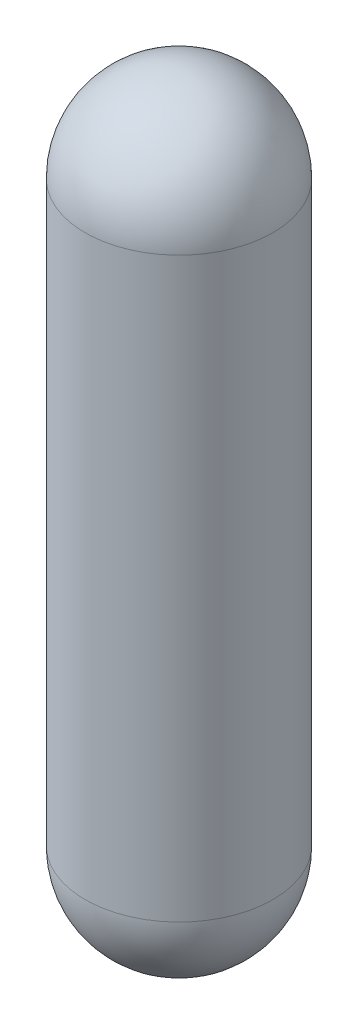
ISO-10303-21;
HEADER;
FILE_DESCRIPTION(('STEP AP214'),'2;1');
FILE_NAME('part.step','',(''),(''),'','','');
FILE_SCHEMA(('AUTOMOTIVE_DESIGN { 1 0 10303 214 1 1 1 1 }'));
ENDSEC;
DATA;
#1=APPLICATION_CONTEXT('core data for automotive mechanical design processes');
#2=APPLICATION_PROTOCOL_DEFINITION('international standard','automotive_design',2000,#1);
#3=PRODUCT_CONTEXT('',#1,'mechanical');
#4=PRODUCT('Part','Part','',(#3));
#5=PRODUCT_RELATED_PRODUCT_CATEGORY('part','',(#4));
#6=PRODUCT_DEFINITION_FORMATION('','',#4);
#7=PRODUCT_DEFINITION_CONTEXT('part definition',#1,'design');
#8=PRODUCT_DEFINITION('design','',#6,#7);
#9=PRODUCT_DEFINITION_SHAPE('','',#8);
#10=(LENGTH_UNIT() NAMED_UNIT(*) SI_UNIT(.MILLI.,.METRE.));
#11=(NAMED_UNIT(*) PLANE_ANGLE_UNIT() SI_UNIT($,.RADIAN.));
#12=(NAMED_UNIT(*) SI_UNIT($,.STERADIAN.) SOLID_ANGLE_UNIT());
#13=UNCERTAINTY_MEASURE_WITH_UNIT(LENGTH_MEASURE(1.E-05),#10,'distance_accuracy_value','');
#14=(GEOMETRIC_REPRESENTATION_CONTEXT(3) GLOBAL_UNCERTAINTY_ASSIGNED_CONTEXT((#13)) GLOBAL_UNIT_ASSIGNED_CONTEXT((#10,
#11,#12)) REPRESENTATION_CONTEXT('',''));
#15=CARTESIAN_POINT('',(0.,0.,0.));
#16=DIRECTION('',(0.,0.,1.));
#17=DIRECTION('',(1.,0.,0.));
#18=AXIS2_PLACEMENT_3D('',#15,#16,#17);
#19=CARTESIAN_POINT('',(0.,-1553.82946096654,0.));
#20=DIRECTION('',(0.,-1.,0.));
#21=DIRECTION('',(1.,0.,0.));
#22=AXIS2_PLACEMENT_3D('',#19,#20,#21);
#23=SPHERICAL_SURFACE('',#22,539.75);
#24=CARTESIAN_POINT('',(0.,-1553.82946096654,0.));
#25=DIRECTION('',(0.,-1.,0.));
#26=DIRECTION('',(1.,0.,0.));
#27=AXIS2_PLACEMENT_3D('',#24,#25,#26);
#28=CIRCLE('',#27,539.75);
#29=CARTESIAN_POINT('',(539.75,-1553.82946096654,0.));
#30=VERTEX_POINT('',#29);
#31=EDGE_CURVE('E44',#30,#30,#28,.T.);
#32=ORIENTED_EDGE('',*,*,#31,.T.);
#33=EDGE_LOOP('',(#32));
#34=FACE_BOUND('',#33,.T.);
#35=ADVANCED_FACE('F38',(#34),#23,.T.);
#36=CARTESIAN_POINT('',(0.,1766.67053903346,0.));
#37=DIRECTION('',(0.,-1.,0.));
#38=DIRECTION('',(1.,0.,0.));
#39=AXIS2_PLACEMENT_3D('',#36,#37,#38);
#40=SPHERICAL_SURFACE('',#39,539.75);
#41=CARTESIAN_POINT('',(0.,1766.67053903346,0.));
#42=DIRECTION('',(0.,-1.,0.));
#43=DIRECTION('',(1.,0.,0.));
#44=AXIS2_PLACEMENT_3D('',#41,#42,#43);
#45=CIRCLE('',#44,539.75);
#46=CARTESIAN_POINT('',(539.75,1766.67053903346,0.));
#47=VERTEX_POINT('',#46);
#48=EDGE_CURVE('E10',#47,#47,#45,.T.);
#49=ORIENTED_EDGE('',*,*,#48,.F.);
#50=EDGE_LOOP('',(#49));
#51=FACE_BOUND('',#50,.T.);
#52=ADVANCED_FACE('F53',(#51),#40,.T.);
#53=CARTESIAN_POINT('',(0.,-1553.82946096654,0.));
#54=DIRECTION('',(0.,-1.,0.));
#55=DIRECTION('',(1.,0.,0.));
#56=AXIS2_PLACEMENT_3D('',#53,#54,#55);
#57=CYLINDRICAL_SURFACE('',#56,539.75);
#58=ORIENTED_EDGE('',*,*,#48,.T.);
#59=EDGE_LOOP('',(#58));
#60=FACE_BOUND('',#59,.T.);
#61=ORIENTED_EDGE('',*,*,#31,.F.);
#62=EDGE_LOOP('',(#61));
#63=FACE_BOUND('',#62,.T.);
#64=ADVANCED_FACE('F51',(#60,#63),#57,.T.);
#65=CLOSED_SHELL('',(#35,#52,#64));
#66=MANIFOLD_SOLID_BREP('B2',#65);
#67=ADVANCED_BREP_SHAPE_REPRESENTATION('',(#18,#66),#14);
#68=SHAPE_DEFINITION_REPRESENTATION(#9,#67);
ENDSEC;
END-ISO-10303-21;
